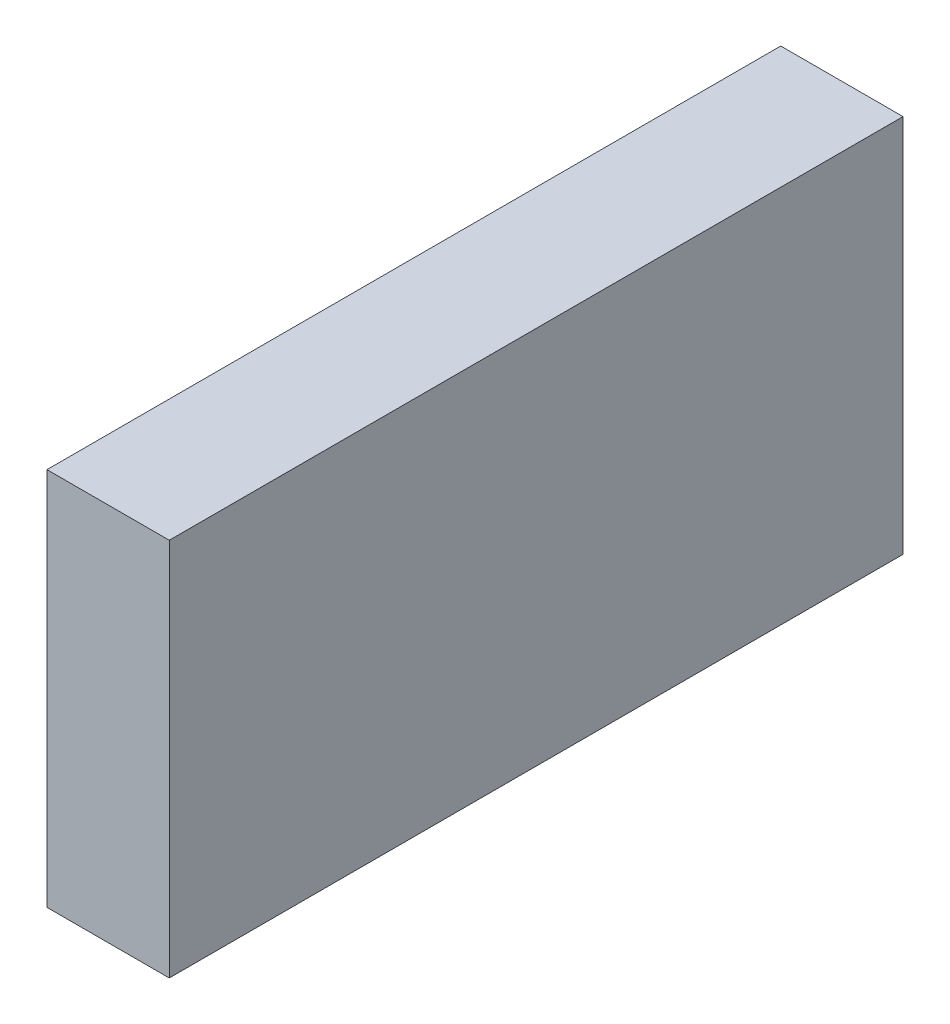
ISO-10303-21;
HEADER;
FILE_DESCRIPTION(('STEP AP214'),'2;1');
FILE_NAME('part.step','',(''),(''),'','','');
FILE_SCHEMA(('AUTOMOTIVE_DESIGN { 1 0 10303 214 1 1 1 1 }'));
ENDSEC;
DATA;
#1=APPLICATION_CONTEXT('core data for automotive mechanical design processes');
#2=APPLICATION_PROTOCOL_DEFINITION('international standard','automotive_design',2000,#1);
#3=PRODUCT_CONTEXT('',#1,'mechanical');
#4=PRODUCT('Part','Part','',(#3));
#5=PRODUCT_RELATED_PRODUCT_CATEGORY('part','',(#4));
#6=PRODUCT_DEFINITION_FORMATION('','',#4);
#7=PRODUCT_DEFINITION_CONTEXT('part definition',#1,'design');
#8=PRODUCT_DEFINITION('design','',#6,#7);
#9=PRODUCT_DEFINITION_SHAPE('','',#8);
#10=(LENGTH_UNIT() NAMED_UNIT(*) SI_UNIT(.MILLI.,.METRE.));
#11=(NAMED_UNIT(*) PLANE_ANGLE_UNIT() SI_UNIT($,.RADIAN.));
#12=(NAMED_UNIT(*) SI_UNIT($,.STERADIAN.) SOLID_ANGLE_UNIT());
#13=UNCERTAINTY_MEASURE_WITH_UNIT(LENGTH_MEASURE(1.E-05),#10,'distance_accuracy_value','');
#14=(GEOMETRIC_REPRESENTATION_CONTEXT(3) GLOBAL_UNCERTAINTY_ASSIGNED_CONTEXT((#13)) GLOBAL_UNIT_ASSIGNED_CONTEXT((#10,
#11,#12)) REPRESENTATION_CONTEXT('',''));
#15=CARTESIAN_POINT('',(0.,0.,0.));
#16=DIRECTION('',(0.,0.,1.));
#17=DIRECTION('',(1.,0.,0.));
#18=AXIS2_PLACEMENT_3D('',#15,#16,#17);
#19=CARTESIAN_POINT('',(12.7,0.,0.));
#20=DIRECTION('',(0.,0.,-1.));
#21=DIRECTION('',(0.,1.,0.));
#22=AXIS2_PLACEMENT_3D('',#19,#20,#21);
#23=PLANE('',#22);
#24=DIRECTION('',(0.,-1.,0.));
#25=VECTOR('',#24,1.);
#26=CARTESIAN_POINT('',(0.,0.,0.));
#27=LINE('',#26,#25);
#28=CARTESIAN_POINT('',(0.,39.37,0.));
#29=VERTEX_POINT('',#28);
#30=CARTESIAN_POINT('',(0.,0.,0.));
#31=VERTEX_POINT('',#30);
#32=EDGE_CURVE('E96',#29,#31,#27,.T.);
#33=ORIENTED_EDGE('',*,*,#32,.T.);
#34=DIRECTION('',(-1.,0.,0.));
#35=VECTOR('',#34,1.);
#36=CARTESIAN_POINT('',(12.7,0.,0.));
#37=LINE('',#36,#35);
#38=CARTESIAN_POINT('',(12.7,0.,0.));
#39=VERTEX_POINT('',#38);
#40=EDGE_CURVE('E11',#39,#31,#37,.T.);
#41=ORIENTED_EDGE('',*,*,#40,.F.);
#42=DIRECTION('',(0.,-1.,0.));
#43=VECTOR('',#42,1.);
#44=CARTESIAN_POINT('',(12.7,0.,0.));
#45=LINE('',#44,#43);
#46=CARTESIAN_POINT('',(12.7,39.37,0.));
#47=VERTEX_POINT('',#46);
#48=EDGE_CURVE('E84',#47,#39,#45,.T.);
#49=ORIENTED_EDGE('',*,*,#48,.F.);
#50=DIRECTION('',(-1.,0.,0.));
#51=VECTOR('',#50,1.);
#52=CARTESIAN_POINT('',(12.7,39.37,0.));
#53=LINE('',#52,#51);
#54=EDGE_CURVE('E92',#47,#29,#53,.T.);
#55=ORIENTED_EDGE('',*,*,#54,.T.);
#56=EDGE_LOOP('',(#33,#41,#49,#55));
#57=FACE_BOUND('',#56,.T.);
#58=ADVANCED_FACE('F33',(#57),#23,.F.);
#59=CARTESIAN_POINT('',(12.7,0.,0.));
#60=DIRECTION('',(0.,1.,0.));
#61=DIRECTION('',(0.,0.,1.));
#62=AXIS2_PLACEMENT_3D('',#59,#60,#61);
#63=PLANE('',#62);
#64=DIRECTION('',(0.,0.,-1.));
#65=VECTOR('',#64,1.);
#66=CARTESIAN_POINT('',(0.,0.,0.));
#67=LINE('',#66,#65);
#68=CARTESIAN_POINT('',(0.,0.,-76.2));
#69=VERTEX_POINT('',#68);
#70=EDGE_CURVE('E88',#31,#69,#67,.T.);
#71=ORIENTED_EDGE('',*,*,#70,.T.);
#72=DIRECTION('',(-1.,0.,0.));
#73=VECTOR('',#72,1.);
#74=CARTESIAN_POINT('',(12.7,0.,-76.2));
#75=LINE('',#74,#73);
#76=CARTESIAN_POINT('',(12.7,0.,-76.2));
#77=VERTEX_POINT('',#76);
#78=EDGE_CURVE('E41',#77,#69,#75,.T.);
#79=ORIENTED_EDGE('',*,*,#78,.F.);
#80=DIRECTION('',(0.,0.,-1.));
#81=VECTOR('',#80,1.);
#82=CARTESIAN_POINT('',(12.7,0.,0.));
#83=LINE('',#82,#81);
#84=EDGE_CURVE('E79',#39,#77,#83,.T.);
#85=ORIENTED_EDGE('',*,*,#84,.F.);
#86=ORIENTED_EDGE('',*,*,#40,.T.);
#87=EDGE_LOOP('',(#71,#79,#85,#86));
#88=FACE_BOUND('',#87,.T.);
#89=ADVANCED_FACE('F87',(#88),#63,.F.);
#90=CARTESIAN_POINT('',(12.7,0.,-76.2));
#91=DIRECTION('',(0.,0.,1.));
#92=DIRECTION('',(0.,-1.,0.));
#93=AXIS2_PLACEMENT_3D('',#90,#91,#92);
#94=PLANE('',#93);
#95=DIRECTION('',(0.,1.,0.));
#96=VECTOR('',#95,1.);
#97=CARTESIAN_POINT('',(0.,0.,-76.2));
#98=LINE('',#97,#96);
#99=CARTESIAN_POINT('',(0.,39.37,-76.2));
#100=VERTEX_POINT('',#99);
#101=EDGE_CURVE('E66',#69,#100,#98,.T.);
#102=ORIENTED_EDGE('',*,*,#101,.T.);
#103=DIRECTION('',(-1.,0.,0.));
#104=VECTOR('',#103,1.);
#105=CARTESIAN_POINT('',(12.7,39.37,-76.2));
#106=LINE('',#105,#104);
#107=CARTESIAN_POINT('',(12.7,39.37,-76.2));
#108=VERTEX_POINT('',#107);
#109=EDGE_CURVE('E89',#108,#100,#106,.T.);
#110=ORIENTED_EDGE('',*,*,#109,.F.);
#111=DIRECTION('',(0.,1.,0.));
#112=VECTOR('',#111,1.);
#113=CARTESIAN_POINT('',(12.7,0.,-76.2));
#114=LINE('',#113,#112);
#115=EDGE_CURVE('E82',#77,#108,#114,.T.);
#116=ORIENTED_EDGE('',*,*,#115,.F.);
#117=ORIENTED_EDGE('',*,*,#78,.T.);
#118=EDGE_LOOP('',(#102,#110,#116,#117));
#119=FACE_BOUND('',#118,.T.);
#120=ADVANCED_FACE('F90',(#119),#94,.F.);
#121=CARTESIAN_POINT('',(12.7,39.37,0.));
#122=DIRECTION('',(0.,-1.,0.));
#123=DIRECTION('',(0.,0.,-1.));
#124=AXIS2_PLACEMENT_3D('',#121,#122,#123);
#125=PLANE('',#124);
#126=DIRECTION('',(0.,0.,1.));
#127=VECTOR('',#126,1.);
#128=CARTESIAN_POINT('',(0.,39.37,0.));
#129=LINE('',#128,#127);
#130=EDGE_CURVE('E72',#100,#29,#129,.T.);
#131=ORIENTED_EDGE('',*,*,#130,.T.);
#132=ORIENTED_EDGE('',*,*,#54,.F.);
#133=DIRECTION('',(0.,0.,1.));
#134=VECTOR('',#133,1.);
#135=CARTESIAN_POINT('',(12.7,39.37,0.));
#136=LINE('',#135,#134);
#137=EDGE_CURVE('E49',#108,#47,#136,.T.);
#138=ORIENTED_EDGE('',*,*,#137,.F.);
#139=ORIENTED_EDGE('',*,*,#109,.T.);
#140=EDGE_LOOP('',(#131,#132,#138,#139));
#141=FACE_BOUND('',#140,.T.);
#142=ADVANCED_FACE('F103',(#141),#125,.F.);
#143=CARTESIAN_POINT('',(12.7,0.,0.));
#144=DIRECTION('',(-1.,0.,0.));
#145=DIRECTION('',(0.,0.,1.));
#146=AXIS2_PLACEMENT_3D('',#143,#144,#145);
#147=PLANE('',#146);
#148=ORIENTED_EDGE('',*,*,#48,.T.);
#149=ORIENTED_EDGE('',*,*,#84,.T.);
#150=ORIENTED_EDGE('',*,*,#115,.T.);
#151=ORIENTED_EDGE('',*,*,#137,.T.);
#152=EDGE_LOOP('',(#148,#149,#150,#151));
#153=FACE_BOUND('',#152,.T.);
#154=ADVANCED_FACE('F80',(#153),#147,.F.);
#155=CARTESIAN_POINT('',(0.,0.,0.));
#156=DIRECTION('',(-1.,0.,0.));
#157=DIRECTION('',(0.,0.,1.));
#158=AXIS2_PLACEMENT_3D('',#155,#156,#157);
#159=PLANE('',#158);
#160=ORIENTED_EDGE('',*,*,#32,.F.);
#161=ORIENTED_EDGE('',*,*,#130,.F.);
#162=ORIENTED_EDGE('',*,*,#101,.F.);
#163=ORIENTED_EDGE('',*,*,#70,.F.);
#164=EDGE_LOOP('',(#160,#161,#162,#163));
#165=FACE_BOUND('',#164,.T.);
#166=ADVANCED_FACE('F106',(#165),#159,.T.);
#167=CLOSED_SHELL('',(#58,#89,#120,#142,#154,#166));
#168=MANIFOLD_SOLID_BREP('B2',#167);
#169=ADVANCED_BREP_SHAPE_REPRESENTATION('',(#18,#168),#14);
#170=SHAPE_DEFINITION_REPRESENTATION(#9,#169);
ENDSEC;
END-ISO-10303-21;
